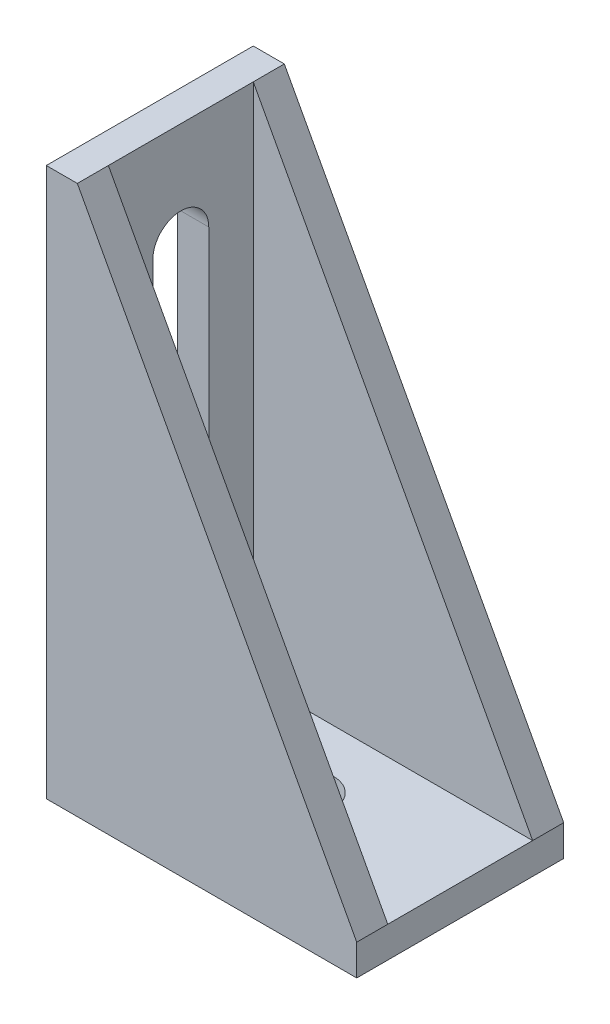
ISO-10303-21;
HEADER;
FILE_DESCRIPTION(('STEP AP214'),'2;1');
FILE_NAME('part.step','',(''),(''),'','','');
FILE_SCHEMA(('AUTOMOTIVE_DESIGN { 1 0 10303 214 1 1 1 1 }'));
ENDSEC;
DATA;
#1=APPLICATION_CONTEXT('core data for automotive mechanical design processes');
#2=APPLICATION_PROTOCOL_DEFINITION('international standard','automotive_design',2000,#1);
#3=PRODUCT_CONTEXT('',#1,'mechanical');
#4=PRODUCT('Part','Part','',(#3));
#5=PRODUCT_RELATED_PRODUCT_CATEGORY('part','',(#4));
#6=PRODUCT_DEFINITION_FORMATION('','',#4);
#7=PRODUCT_DEFINITION_CONTEXT('part definition',#1,'design');
#8=PRODUCT_DEFINITION('design','',#6,#7);
#9=PRODUCT_DEFINITION_SHAPE('','',#8);
#10=(LENGTH_UNIT() NAMED_UNIT(*) SI_UNIT(.MILLI.,.METRE.));
#11=(NAMED_UNIT(*) PLANE_ANGLE_UNIT() SI_UNIT($,.RADIAN.));
#12=(NAMED_UNIT(*) SI_UNIT($,.STERADIAN.) SOLID_ANGLE_UNIT());
#13=UNCERTAINTY_MEASURE_WITH_UNIT(LENGTH_MEASURE(1.E-05),#10,'distance_accuracy_value','');
#14=(GEOMETRIC_REPRESENTATION_CONTEXT(3) GLOBAL_UNCERTAINTY_ASSIGNED_CONTEXT((#13)) GLOBAL_UNIT_ASSIGNED_CONTEXT((#10,
#11,#12)) REPRESENTATION_CONTEXT('',''));
#15=CARTESIAN_POINT('',(0.,0.,0.));
#16=DIRECTION('',(0.,0.,1.));
#17=DIRECTION('',(1.,0.,0.));
#18=AXIS2_PLACEMENT_3D('',#15,#16,#17);
#19=CARTESIAN_POINT('',(0.,3.,0.));
#20=DIRECTION('',(0.,1.,0.));
#21=DIRECTION('',(0.,0.,1.));
#22=AXIS2_PLACEMENT_3D('',#19,#20,#21);
#23=PLANE('',#22);
#24=CARTESIAN_POINT('',(0.,3.,0.));
#25=DIRECTION('',(0.,1.,0.));
#26=DIRECTION('',(0.,0.,1.));
#27=AXIS2_PLACEMENT_3D('',#24,#25,#26);
#28=CIRCLE('',#27,2.75);
#29=CARTESIAN_POINT('',(0.,3.,2.75));
#30=VERTEX_POINT('',#29);
#31=EDGE_CURVE('E199',#30,#30,#28,.T.);
#32=ORIENTED_EDGE('',*,*,#31,.F.);
#33=EDGE_LOOP('',(#32));
#34=FACE_BOUND('',#33,.T.);
#35=DIRECTION('',(0.,0.,-1.));
#36=VECTOR('',#35,1.);
#37=CARTESIAN_POINT('',(15.,3.,-10.));
#38=LINE('',#37,#36);
#39=CARTESIAN_POINT('',(15.,3.00000000000002,7.));
#40=VERTEX_POINT('',#39);
#41=CARTESIAN_POINT('',(15.,3.00000000000002,-7.));
#42=VERTEX_POINT('',#41);
#43=EDGE_CURVE('E208',#40,#42,#38,.T.);
#44=ORIENTED_EDGE('',*,*,#43,.T.);
#45=DIRECTION('',(-1.,0.,0.));
#46=VECTOR('',#45,1.);
#47=CARTESIAN_POINT('',(0.,3.,-7.));
#48=LINE('',#47,#46);
#49=CARTESIAN_POINT('',(-12.,3.,-7.));
#50=VERTEX_POINT('',#49);
#51=EDGE_CURVE('E166',#42,#50,#48,.T.);
#52=ORIENTED_EDGE('',*,*,#51,.T.);
#53=DIRECTION('',(0.,0.,-1.));
#54=VECTOR('',#53,1.);
#55=CARTESIAN_POINT('',(-12.,3.,-10.));
#56=LINE('',#55,#54);
#57=CARTESIAN_POINT('',(-12.,3.,7.));
#58=VERTEX_POINT('',#57);
#59=EDGE_CURVE('E182',#58,#50,#56,.T.);
#60=ORIENTED_EDGE('',*,*,#59,.F.);
#61=DIRECTION('',(1.,0.,0.));
#62=VECTOR('',#61,1.);
#63=CARTESIAN_POINT('',(0.,3.,7.));
#64=LINE('',#63,#62);
#65=EDGE_CURVE('E179',#58,#40,#64,.T.);
#66=ORIENTED_EDGE('',*,*,#65,.T.);
#67=EDGE_LOOP('',(#44,#52,#60,#66));
#68=FACE_BOUND('',#67,.T.);
#69=ADVANCED_FACE('F33',(#34,#68),#23,.T.);
#70=CARTESIAN_POINT('',(-12.,53.,-10.));
#71=DIRECTION('',(-1.,0.,0.));
#72=DIRECTION('',(0.,0.,1.));
#73=AXIS2_PLACEMENT_3D('',#70,#71,#72);
#74=PLANE('',#73);
#75=DIRECTION('',(0.,-1.,0.));
#76=VECTOR('',#75,1.);
#77=CARTESIAN_POINT('',(-12.,43.,2.7));
#78=LINE('',#77,#76);
#79=CARTESIAN_POINT('',(-12.,43.,2.7));
#80=VERTEX_POINT('',#79);
#81=CARTESIAN_POINT('',(-12.,8.,2.7));
#82=VERTEX_POINT('',#81);
#83=EDGE_CURVE('E149',#80,#82,#78,.T.);
#84=ORIENTED_EDGE('',*,*,#83,.F.);
#85=CARTESIAN_POINT('',(-12.,43.,0.));
#86=DIRECTION('',(1.,0.,0.));
#87=DIRECTION('',(0.,0.,-1.));
#88=AXIS2_PLACEMENT_3D('',#85,#86,#87);
#89=CIRCLE('',#88,2.7);
#90=CARTESIAN_POINT('',(-12.,43.,-2.7));
#91=VERTEX_POINT('',#90);
#92=EDGE_CURVE('E48',#91,#80,#89,.T.);
#93=ORIENTED_EDGE('',*,*,#92,.F.);
#94=DIRECTION('',(0.,1.,0.));
#95=VECTOR('',#94,1.);
#96=CARTESIAN_POINT('',(-12.,43.,-2.7));
#97=LINE('',#96,#95);
#98=CARTESIAN_POINT('',(-12.,8.,-2.7));
#99=VERTEX_POINT('',#98);
#100=EDGE_CURVE('E140',#99,#91,#97,.T.);
#101=ORIENTED_EDGE('',*,*,#100,.F.);
#102=CARTESIAN_POINT('',(-12.,8.,0.));
#103=DIRECTION('',(1.,0.,0.));
#104=DIRECTION('',(0.,0.,-1.));
#105=AXIS2_PLACEMENT_3D('',#102,#103,#104);
#106=CIRCLE('',#105,2.7);
#107=EDGE_CURVE('E143',#82,#99,#106,.T.);
#108=ORIENTED_EDGE('',*,*,#107,.F.);
#109=EDGE_LOOP('',(#84,#93,#101,#108));
#110=FACE_BOUND('',#109,.T.);
#111=DIRECTION('',(0.,-1.,0.));
#112=VECTOR('',#111,1.);
#113=CARTESIAN_POINT('',(-12.,53.,-7.));
#114=LINE('',#113,#112);
#115=CARTESIAN_POINT('',(-12.,53.,-7.));
#116=VERTEX_POINT('',#115);
#117=EDGE_CURVE('E162',#116,#50,#114,.T.);
#118=ORIENTED_EDGE('',*,*,#117,.F.);
#119=DIRECTION('',(0.,0.,-1.));
#120=VECTOR('',#119,1.);
#121=CARTESIAN_POINT('',(-12.,53.,-10.));
#122=LINE('',#121,#120);
#123=CARTESIAN_POINT('',(-12.,53.,7.));
#124=VERTEX_POINT('',#123);
#125=EDGE_CURVE('E193',#124,#116,#122,.T.);
#126=ORIENTED_EDGE('',*,*,#125,.F.);
#127=DIRECTION('',(0.,1.,0.));
#128=VECTOR('',#127,1.);
#129=CARTESIAN_POINT('',(-12.,53.,7.));
#130=LINE('',#129,#128);
#131=EDGE_CURVE('E174',#58,#124,#130,.T.);
#132=ORIENTED_EDGE('',*,*,#131,.F.);
#133=ORIENTED_EDGE('',*,*,#59,.T.);
#134=EDGE_LOOP('',(#118,#126,#132,#133));
#135=FACE_BOUND('',#134,.T.);
#136=ADVANCED_FACE('F253',(#110,#135),#74,.F.);
#137=CARTESIAN_POINT('',(0.,0.,0.));
#138=DIRECTION('',(0.,1.,0.));
#139=DIRECTION('',(0.,0.,1.));
#140=AXIS2_PLACEMENT_3D('',#137,#138,#139);
#141=PLANE('',#140);
#142=DIRECTION('',(-1.,0.,0.));
#143=VECTOR('',#142,1.);
#144=CARTESIAN_POINT('',(-15.,0.,-10.));
#145=LINE('',#144,#143);
#146=CARTESIAN_POINT('',(15.,0.,-10.));
#147=VERTEX_POINT('',#146);
#148=CARTESIAN_POINT('',(-15.,0.,-10.));
#149=VERTEX_POINT('',#148);
#150=EDGE_CURVE('E210',#147,#149,#145,.T.);
#151=ORIENTED_EDGE('',*,*,#150,.F.);
#152=DIRECTION('',(0.,0.,-1.));
#153=VECTOR('',#152,1.);
#154=CARTESIAN_POINT('',(15.,0.,-10.));
#155=LINE('',#154,#153);
#156=CARTESIAN_POINT('',(15.,0.,10.));
#157=VERTEX_POINT('',#156);
#158=EDGE_CURVE('E202',#157,#147,#155,.T.);
#159=ORIENTED_EDGE('',*,*,#158,.F.);
#160=DIRECTION('',(1.,0.,0.));
#161=VECTOR('',#160,1.);
#162=CARTESIAN_POINT('',(-15.,0.,10.));
#163=LINE('',#162,#161);
#164=CARTESIAN_POINT('',(-15.,0.,10.));
#165=VERTEX_POINT('',#164);
#166=EDGE_CURVE('E214',#165,#157,#163,.T.);
#167=ORIENTED_EDGE('',*,*,#166,.F.);
#168=DIRECTION('',(0.,0.,1.));
#169=VECTOR('',#168,1.);
#170=CARTESIAN_POINT('',(-15.,0.,-10.));
#171=LINE('',#170,#169);
#172=EDGE_CURVE('E212',#149,#165,#171,.T.);
#173=ORIENTED_EDGE('',*,*,#172,.F.);
#174=EDGE_LOOP('',(#151,#159,#167,#173));
#175=FACE_BOUND('',#174,.T.);
#176=CARTESIAN_POINT('',(0.,0.,0.));
#177=DIRECTION('',(0.,1.,0.));
#178=DIRECTION('',(0.,0.,1.));
#179=AXIS2_PLACEMENT_3D('',#176,#177,#178);
#180=CIRCLE('',#179,2.75);
#181=CARTESIAN_POINT('',(0.,0.,2.75));
#182=VERTEX_POINT('',#181);
#183=EDGE_CURVE('E196',#182,#182,#180,.T.);
#184=ORIENTED_EDGE('',*,*,#183,.T.);
#185=EDGE_LOOP('',(#184));
#186=FACE_BOUND('',#185,.T.);
#187=ADVANCED_FACE('F229',(#175,#186),#141,.F.);
#188=CARTESIAN_POINT('',(15.,3.,-10.));
#189=DIRECTION('',(-1.,0.,0.));
#190=DIRECTION('',(0.,0.,1.));
#191=AXIS2_PLACEMENT_3D('',#188,#189,#190);
#192=PLANE('',#191);
#193=DIRECTION('',(0.,0.,-1.));
#194=VECTOR('',#193,1.);
#195=CARTESIAN_POINT('',(15.,3.00000000000001,-10.));
#196=LINE('',#195,#194);
#197=CARTESIAN_POINT('',(15.,3.00000000000003,-10.));
#198=VERTEX_POINT('',#197);
#199=EDGE_CURVE('E169',#42,#198,#196,.T.);
#200=ORIENTED_EDGE('',*,*,#199,.F.);
#201=ORIENTED_EDGE('',*,*,#43,.F.);
#202=CARTESIAN_POINT('',(15.,3.,10.));
#203=VERTEX_POINT('',#202);
#204=EDGE_CURVE('E205',#203,#40,#38,.T.);
#205=ORIENTED_EDGE('',*,*,#204,.F.);
#206=DIRECTION('',(0.,-1.,0.));
#207=VECTOR('',#206,1.);
#208=CARTESIAN_POINT('',(15.,3.,10.));
#209=LINE('',#208,#207);
#210=EDGE_CURVE('E207',#203,#157,#209,.T.);
#211=ORIENTED_EDGE('',*,*,#210,.T.);
#212=ORIENTED_EDGE('',*,*,#158,.T.);
#213=DIRECTION('',(0.,-1.,0.));
#214=VECTOR('',#213,1.);
#215=CARTESIAN_POINT('',(15.,3.,-10.));
#216=LINE('',#215,#214);
#217=EDGE_CURVE('E11',#198,#147,#216,.T.);
#218=ORIENTED_EDGE('',*,*,#217,.F.);
#219=EDGE_LOOP('',(#200,#201,#205,#211,#212,#218));
#220=FACE_BOUND('',#219,.T.);
#221=ADVANCED_FACE('F35',(#220),#192,.F.);
#222=CARTESIAN_POINT('',(-15.,3.,-10.));
#223=DIRECTION('',(0.,0.,1.));
#224=DIRECTION('',(1.,0.,0.));
#225=AXIS2_PLACEMENT_3D('',#222,#223,#224);
#226=PLANE('',#225);
#227=ORIENTED_EDGE('',*,*,#150,.T.);
#228=DIRECTION('',(0.,-1.,0.));
#229=VECTOR('',#228,1.);
#230=CARTESIAN_POINT('',(-15.,3.,-10.));
#231=LINE('',#230,#229);
#232=CARTESIAN_POINT('',(-15.,53.,-10.));
#233=VERTEX_POINT('',#232);
#234=EDGE_CURVE('E41',#233,#149,#231,.T.);
#235=ORIENTED_EDGE('',*,*,#234,.F.);
#236=DIRECTION('',(-1.,0.,0.));
#237=VECTOR('',#236,1.);
#238=CARTESIAN_POINT('',(-15.,53.,-10.));
#239=LINE('',#238,#237);
#240=CARTESIAN_POINT('',(-12.,53.,-10.));
#241=VERTEX_POINT('',#240);
#242=EDGE_CURVE('E192',#241,#233,#239,.T.);
#243=ORIENTED_EDGE('',*,*,#242,.F.);
#244=DIRECTION('',(0.475148914734884,-0.879905397657192,0.));
#245=VECTOR('',#244,1.);
#246=CARTESIAN_POINT('',(-12.,53.,-10.));
#247=LINE('',#246,#245);
#248=EDGE_CURVE('E159',#241,#198,#247,.T.);
#249=ORIENTED_EDGE('',*,*,#248,.T.);
#250=ORIENTED_EDGE('',*,*,#217,.T.);
#251=EDGE_LOOP('',(#227,#235,#243,#249,#250));
#252=FACE_BOUND('',#251,.T.);
#253=ADVANCED_FACE('F258',(#252),#226,.F.);
#254=CARTESIAN_POINT('',(-15.,3.,-10.));
#255=DIRECTION('',(1.,0.,0.));
#256=DIRECTION('',(0.,0.,-1.));
#257=AXIS2_PLACEMENT_3D('',#254,#255,#256);
#258=PLANE('',#257);
#259=DIRECTION('',(0.,1.,0.));
#260=VECTOR('',#259,1.);
#261=CARTESIAN_POINT('',(-15.,43.,-2.7));
#262=LINE('',#261,#260);
#263=CARTESIAN_POINT('',(-15.,8.,-2.7));
#264=VERTEX_POINT('',#263);
#265=CARTESIAN_POINT('',(-15.,43.,-2.7));
#266=VERTEX_POINT('',#265);
#267=EDGE_CURVE('E130',#264,#266,#262,.T.);
#268=ORIENTED_EDGE('',*,*,#267,.T.);
#269=CARTESIAN_POINT('',(-15.,43.,0.));
#270=DIRECTION('',(1.,0.,0.));
#271=DIRECTION('',(0.,0.,-1.));
#272=AXIS2_PLACEMENT_3D('',#269,#270,#271);
#273=CIRCLE('',#272,2.7);
#274=CARTESIAN_POINT('',(-15.,43.,2.7));
#275=VERTEX_POINT('',#274);
#276=EDGE_CURVE('E124',#266,#275,#273,.T.);
#277=ORIENTED_EDGE('',*,*,#276,.T.);
#278=DIRECTION('',(0.,-1.,0.));
#279=VECTOR('',#278,1.);
#280=CARTESIAN_POINT('',(-15.,43.,2.7));
#281=LINE('',#280,#279);
#282=CARTESIAN_POINT('',(-15.,8.,2.7));
#283=VERTEX_POINT('',#282);
#284=EDGE_CURVE('E133',#275,#283,#281,.T.);
#285=ORIENTED_EDGE('',*,*,#284,.T.);
#286=CARTESIAN_POINT('',(-15.,8.,0.));
#287=DIRECTION('',(1.,0.,0.));
#288=DIRECTION('',(0.,0.,-1.));
#289=AXIS2_PLACEMENT_3D('',#286,#287,#288);
#290=CIRCLE('',#289,2.7);
#291=EDGE_CURVE('E56',#283,#264,#290,.T.);
#292=ORIENTED_EDGE('',*,*,#291,.T.);
#293=EDGE_LOOP('',(#268,#277,#285,#292));
#294=FACE_BOUND('',#293,.T.);
#295=ORIENTED_EDGE('',*,*,#172,.T.);
#296=DIRECTION('',(0.,-1.,0.));
#297=VECTOR('',#296,1.);
#298=CARTESIAN_POINT('',(-15.,3.,10.));
#299=LINE('',#298,#297);
#300=CARTESIAN_POINT('',(-15.,53.,10.));
#301=VERTEX_POINT('',#300);
#302=EDGE_CURVE('E218',#301,#165,#299,.T.);
#303=ORIENTED_EDGE('',*,*,#302,.F.);
#304=DIRECTION('',(0.,0.,1.));
#305=VECTOR('',#304,1.);
#306=CARTESIAN_POINT('',(-15.,53.,-10.));
#307=LINE('',#306,#305);
#308=EDGE_CURVE('E183',#233,#301,#307,.T.);
#309=ORIENTED_EDGE('',*,*,#308,.F.);
#310=ORIENTED_EDGE('',*,*,#234,.T.);
#311=EDGE_LOOP('',(#295,#303,#309,#310));
#312=FACE_BOUND('',#311,.T.);
#313=ADVANCED_FACE('F137',(#294,#312),#258,.F.);
#314=CARTESIAN_POINT('',(-15.,3.,10.));
#315=DIRECTION('',(0.,0.,-1.));
#316=DIRECTION('',(-1.,0.,0.));
#317=AXIS2_PLACEMENT_3D('',#314,#315,#316);
#318=PLANE('',#317);
#319=ORIENTED_EDGE('',*,*,#210,.F.);
#320=DIRECTION('',(0.475148914734884,-0.879905397657192,0.));
#321=VECTOR('',#320,1.);
#322=CARTESIAN_POINT('',(-12.,53.,10.));
#323=LINE('',#322,#321);
#324=CARTESIAN_POINT('',(-12.,53.,10.));
#325=VERTEX_POINT('',#324);
#326=EDGE_CURVE('E172',#325,#203,#323,.T.);
#327=ORIENTED_EDGE('',*,*,#326,.F.);
#328=DIRECTION('',(1.,0.,0.));
#329=VECTOR('',#328,1.);
#330=CARTESIAN_POINT('',(-15.,53.,10.));
#331=LINE('',#330,#329);
#332=EDGE_CURVE('E185',#301,#325,#331,.T.);
#333=ORIENTED_EDGE('',*,*,#332,.F.);
#334=ORIENTED_EDGE('',*,*,#302,.T.);
#335=ORIENTED_EDGE('',*,*,#166,.T.);
#336=EDGE_LOOP('',(#319,#327,#333,#334,#335));
#337=FACE_BOUND('',#336,.T.);
#338=ADVANCED_FACE('F234',(#337),#318,.F.);
#339=CARTESIAN_POINT('',(0.,3.,0.));
#340=DIRECTION('',(0.,-1.,0.));
#341=DIRECTION('',(0.,0.,-1.));
#342=AXIS2_PLACEMENT_3D('',#339,#340,#341);
#343=CYLINDRICAL_SURFACE('',#342,2.75);
#344=ORIENTED_EDGE('',*,*,#31,.T.);
#345=EDGE_LOOP('',(#344));
#346=FACE_BOUND('',#345,.T.);
#347=ORIENTED_EDGE('',*,*,#183,.F.);
#348=EDGE_LOOP('',(#347));
#349=FACE_BOUND('',#348,.T.);
#350=ADVANCED_FACE('F284',(#346,#349),#343,.F.);
#351=CARTESIAN_POINT('',(0.,53.,0.));
#352=DIRECTION('',(0.,1.,0.));
#353=DIRECTION('',(0.,0.,1.));
#354=AXIS2_PLACEMENT_3D('',#351,#352,#353);
#355=PLANE('',#354);
#356=ORIENTED_EDGE('',*,*,#308,.T.);
#357=ORIENTED_EDGE('',*,*,#332,.T.);
#358=EDGE_CURVE('E189',#325,#124,#122,.T.);
#359=ORIENTED_EDGE('',*,*,#358,.T.);
#360=ORIENTED_EDGE('',*,*,#125,.T.);
#361=EDGE_CURVE('E188',#116,#241,#122,.T.);
#362=ORIENTED_EDGE('',*,*,#361,.T.);
#363=ORIENTED_EDGE('',*,*,#242,.T.);
#364=EDGE_LOOP('',(#356,#357,#359,#360,#362,#363));
#365=FACE_BOUND('',#364,.T.);
#366=ADVANCED_FACE('F257',(#365),#355,.T.);
#367=CARTESIAN_POINT('',(-12.,53.,10.));
#368=DIRECTION('',(-0.879905397657192,-0.475148914734884,0.));
#369=DIRECTION('',(0.475148914734884,-0.879905397657192,0.));
#370=AXIS2_PLACEMENT_3D('',#367,#368,#369);
#371=PLANE('',#370);
#372=ORIENTED_EDGE('',*,*,#326,.T.);
#373=ORIENTED_EDGE('',*,*,#204,.T.);
#374=DIRECTION('',(0.475148914734884,-0.879905397657192,0.));
#375=VECTOR('',#374,1.);
#376=CARTESIAN_POINT('',(-12.,53.,7.));
#377=LINE('',#376,#375);
#378=EDGE_CURVE('E171',#124,#40,#377,.T.);
#379=ORIENTED_EDGE('',*,*,#378,.F.);
#380=ORIENTED_EDGE('',*,*,#358,.F.);
#381=EDGE_LOOP('',(#372,#373,#379,#380));
#382=FACE_BOUND('',#381,.T.);
#383=ADVANCED_FACE('F244',(#382),#371,.F.);
#384=CARTESIAN_POINT('',(0.,26.5,7.));
#385=DIRECTION('',(0.,0.,1.));
#386=DIRECTION('',(1.,0.,0.));
#387=AXIS2_PLACEMENT_3D('',#384,#385,#386);
#388=PLANE('',#387);
#389=ORIENTED_EDGE('',*,*,#65,.F.);
#390=ORIENTED_EDGE('',*,*,#131,.T.);
#391=ORIENTED_EDGE('',*,*,#378,.T.);
#392=EDGE_LOOP('',(#389,#390,#391));
#393=FACE_BOUND('',#392,.T.);
#394=ADVANCED_FACE('F246',(#393),#388,.F.);
#395=CARTESIAN_POINT('',(-12.,53.,-10.));
#396=DIRECTION('',(0.879905397657192,0.475148914734884,0.));
#397=DIRECTION('',(0.475148914734884,-0.879905397657192,0.));
#398=AXIS2_PLACEMENT_3D('',#395,#396,#397);
#399=PLANE('',#398);
#400=DIRECTION('',(0.475148914734884,-0.879905397657192,0.));
#401=VECTOR('',#400,1.);
#402=CARTESIAN_POINT('',(-12.,53.,-7.));
#403=LINE('',#402,#401);
#404=EDGE_CURVE('E155',#116,#42,#403,.T.);
#405=ORIENTED_EDGE('',*,*,#404,.T.);
#406=ORIENTED_EDGE('',*,*,#199,.T.);
#407=ORIENTED_EDGE('',*,*,#248,.F.);
#408=ORIENTED_EDGE('',*,*,#361,.F.);
#409=EDGE_LOOP('',(#405,#406,#407,#408));
#410=FACE_BOUND('',#409,.T.);
#411=ADVANCED_FACE('F260',(#410),#399,.T.);
#412=CARTESIAN_POINT('',(0.,26.5,-7.));
#413=DIRECTION('',(0.,0.,-1.));
#414=DIRECTION('',(-1.,0.,0.));
#415=AXIS2_PLACEMENT_3D('',#412,#413,#414);
#416=PLANE('',#415);
#417=ORIENTED_EDGE('',*,*,#51,.F.);
#418=ORIENTED_EDGE('',*,*,#404,.F.);
#419=ORIENTED_EDGE('',*,*,#117,.T.);
#420=EDGE_LOOP('',(#417,#418,#419));
#421=FACE_BOUND('',#420,.T.);
#422=ADVANCED_FACE('F263',(#421),#416,.F.);
#423=CARTESIAN_POINT('',(-15.,43.,0.));
#424=DIRECTION('',(1.,0.,0.));
#425=DIRECTION('',(0.,0.,-1.));
#426=AXIS2_PLACEMENT_3D('',#423,#424,#425);
#427=CYLINDRICAL_SURFACE('',#426,2.7);
#428=ORIENTED_EDGE('',*,*,#92,.T.);
#429=DIRECTION('',(1.,0.,0.));
#430=VECTOR('',#429,1.);
#431=CARTESIAN_POINT('',(-15.,43.,2.7));
#432=LINE('',#431,#430);
#433=EDGE_CURVE('E120',#275,#80,#432,.T.);
#434=ORIENTED_EDGE('',*,*,#433,.F.);
#435=ORIENTED_EDGE('',*,*,#276,.F.);
#436=DIRECTION('',(1.,0.,0.));
#437=VECTOR('',#436,1.);
#438=CARTESIAN_POINT('',(-15.,43.,-2.7));
#439=LINE('',#438,#437);
#440=EDGE_CURVE('E153',#266,#91,#439,.T.);
#441=ORIENTED_EDGE('',*,*,#440,.T.);
#442=EDGE_LOOP('',(#428,#434,#435,#441));
#443=FACE_BOUND('',#442,.T.);
#444=ADVANCED_FACE('F122',(#443),#427,.F.);
#445=CARTESIAN_POINT('',(-15.,43.,-2.7));
#446=DIRECTION('',(0.,0.,-1.));
#447=DIRECTION('',(-1.,0.,0.));
#448=AXIS2_PLACEMENT_3D('',#445,#446,#447);
#449=PLANE('',#448);
#450=ORIENTED_EDGE('',*,*,#100,.T.);
#451=ORIENTED_EDGE('',*,*,#440,.F.);
#452=ORIENTED_EDGE('',*,*,#267,.F.);
#453=DIRECTION('',(1.,0.,0.));
#454=VECTOR('',#453,1.);
#455=CARTESIAN_POINT('',(-15.,8.,-2.7));
#456=LINE('',#455,#454);
#457=EDGE_CURVE('E156',#264,#99,#456,.T.);
#458=ORIENTED_EDGE('',*,*,#457,.T.);
#459=EDGE_LOOP('',(#450,#451,#452,#458));
#460=FACE_BOUND('',#459,.T.);
#461=ADVANCED_FACE('F270',(#460),#449,.F.);
#462=CARTESIAN_POINT('',(-15.,8.,0.));
#463=DIRECTION('',(1.,0.,0.));
#464=DIRECTION('',(0.,0.,-1.));
#465=AXIS2_PLACEMENT_3D('',#462,#463,#464);
#466=CYLINDRICAL_SURFACE('',#465,2.7);
#467=ORIENTED_EDGE('',*,*,#107,.T.);
#468=ORIENTED_EDGE('',*,*,#457,.F.);
#469=ORIENTED_EDGE('',*,*,#291,.F.);
#470=DIRECTION('',(1.,0.,0.));
#471=VECTOR('',#470,1.);
#472=CARTESIAN_POINT('',(-15.,8.,2.7));
#473=LINE('',#472,#471);
#474=EDGE_CURVE('E129',#283,#82,#473,.T.);
#475=ORIENTED_EDGE('',*,*,#474,.T.);
#476=EDGE_LOOP('',(#467,#468,#469,#475));
#477=FACE_BOUND('',#476,.T.);
#478=ADVANCED_FACE('F333',(#477),#466,.F.);
#479=CARTESIAN_POINT('',(-15.,43.,2.7));
#480=DIRECTION('',(0.,0.,1.));
#481=DIRECTION('',(1.,0.,0.));
#482=AXIS2_PLACEMENT_3D('',#479,#480,#481);
#483=PLANE('',#482);
#484=ORIENTED_EDGE('',*,*,#83,.T.);
#485=ORIENTED_EDGE('',*,*,#474,.F.);
#486=ORIENTED_EDGE('',*,*,#284,.F.);
#487=ORIENTED_EDGE('',*,*,#433,.T.);
#488=EDGE_LOOP('',(#484,#485,#486,#487));
#489=FACE_BOUND('',#488,.T.);
#490=ADVANCED_FACE('F134',(#489),#483,.F.);
#491=CLOSED_SHELL('',(#69,#136,#187,#221,#253,#313,#338,#350,#366,#383,#394,#411,#422,#444,#461,
#478,#490));
#492=MANIFOLD_SOLID_BREP('B2',#491);
#493=ADVANCED_BREP_SHAPE_REPRESENTATION('',(#18,#492),#14);
#494=SHAPE_DEFINITION_REPRESENTATION(#9,#493);
ENDSEC;
END-ISO-10303-21;
